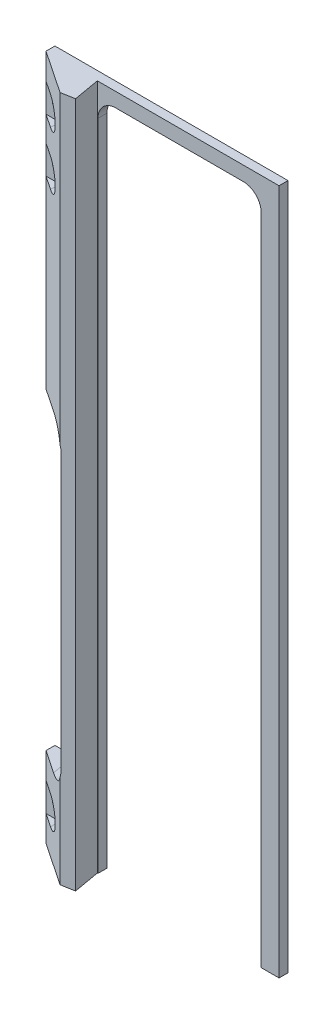
ISO-10303-21;
HEADER;
FILE_DESCRIPTION(('STEP AP214'),'2;1');
FILE_NAME('part.step','',(''),(''),'','','');
FILE_SCHEMA(('AUTOMOTIVE_DESIGN { 1 0 10303 214 1 1 1 1 }'));
ENDSEC;
DATA;
#1=APPLICATION_CONTEXT('core data for automotive mechanical design processes');
#2=APPLICATION_PROTOCOL_DEFINITION('international standard','automotive_design',2000,#1);
#3=PRODUCT_CONTEXT('',#1,'mechanical');
#4=PRODUCT('Part','Part','',(#3));
#5=PRODUCT_RELATED_PRODUCT_CATEGORY('part','',(#4));
#6=PRODUCT_DEFINITION_FORMATION('','',#4);
#7=PRODUCT_DEFINITION_CONTEXT('part definition',#1,'design');
#8=PRODUCT_DEFINITION('design','',#6,#7);
#9=PRODUCT_DEFINITION_SHAPE('','',#8);
#10=(LENGTH_UNIT() NAMED_UNIT(*) SI_UNIT(.MILLI.,.METRE.));
#11=(NAMED_UNIT(*) PLANE_ANGLE_UNIT() SI_UNIT($,.RADIAN.));
#12=(NAMED_UNIT(*) SI_UNIT($,.STERADIAN.) SOLID_ANGLE_UNIT());
#13=UNCERTAINTY_MEASURE_WITH_UNIT(LENGTH_MEASURE(1.E-05),#10,'distance_accuracy_value','');
#14=(GEOMETRIC_REPRESENTATION_CONTEXT(3) GLOBAL_UNCERTAINTY_ASSIGNED_CONTEXT((#13)) GLOBAL_UNIT_ASSIGNED_CONTEXT((#10,
#11,#12)) REPRESENTATION_CONTEXT('',''));
#15=CARTESIAN_POINT('',(0.,0.,0.));
#16=DIRECTION('',(0.,0.,1.));
#17=DIRECTION('',(1.,0.,0.));
#18=AXIS2_PLACEMENT_3D('',#15,#16,#17);
#19=CARTESIAN_POINT('',(828.768626089642,5932.05250361917,3.175));
#20=DIRECTION('',(-0.557788188531674,0.,0.829983335214963));
#21=DIRECTION('',(0.829983335214963,0.,0.557788188531674));
#22=AXIS2_PLACEMENT_3D('',#19,#20,#21);
#23=PLANE('',#22);
#24=DIRECTION('',(0.,-1.,0.));
#25=VECTOR('',#24,1.);
#26=CARTESIAN_POINT('',(828.768626089642,5932.05250361917,3.175));
#27=LINE('',#26,#25);
#28=CARTESIAN_POINT('',(828.768626089642,5960.62750361917,3.17499999999996));
#29=VERTEX_POINT('',#28);
#30=CARTESIAN_POINT('',(828.768626089642,5951.42000361917,3.175));
#31=VERTEX_POINT('',#30);
#32=EDGE_CURVE('E403',#29,#31,#27,.T.);
#33=ORIENTED_EDGE('',*,*,#32,.T.);
#34=DIRECTION('',(0.829983335214963,0.,0.557788188531674));
#35=VECTOR('',#34,1.);
#36=CARTESIAN_POINT('',(828.768626089642,5951.42000361917,3.175));
#37=LINE('',#36,#35);
#38=CARTESIAN_POINT('',(833.658126089642,5951.42000361917,6.46097603362633));
#39=VERTEX_POINT('',#38);
#40=EDGE_CURVE('E12',#31,#39,#37,.T.);
#41=ORIENTED_EDGE('',*,*,#40,.T.);
#42=CARTESIAN_POINT('',(833.658126089642,5946.34000361917,6.46097603362633));
#43=DIRECTION('',(-0.557788188531674,0.,0.829983335214963));
#44=DIRECTION('',(-0.829983335214963,0.,-0.557788188531674));
#45=AXIS2_PLACEMENT_3D('',#42,#43,#44);
#46=ELLIPSE('',#45,6.12060481754699,5.08000000000042);
#47=CARTESIAN_POINT('',(833.658126089642,5941.26000361917,6.46097603362633));
#48=VERTEX_POINT('',#47);
#49=EDGE_CURVE('E50',#39,#48,#46,.F.);
#50=ORIENTED_EDGE('',*,*,#49,.T.);
#51=DIRECTION('',(-0.829983335214963,0.,-0.557788188531674));
#52=VECTOR('',#51,1.);
#53=CARTESIAN_POINT('',(828.768626089642,5941.26000361917,3.175));
#54=LINE('',#53,#52);
#55=CARTESIAN_POINT('',(828.768626089642,5941.26000361917,3.175));
#56=VERTEX_POINT('',#55);
#57=EDGE_CURVE('E520',#48,#56,#54,.T.);
#58=ORIENTED_EDGE('',*,*,#57,.T.);
#59=CARTESIAN_POINT('',(828.768626089642,5932.05250361917,3.175));
#60=VERTEX_POINT('',#59);
#61=EDGE_CURVE('E402',#56,#60,#27,.T.);
#62=ORIENTED_EDGE('',*,*,#61,.T.);
#63=DIRECTION('',(0.829983335214963,0.,0.557788188531674));
#64=VECTOR('',#63,1.);
#65=CARTESIAN_POINT('',(828.768626089642,5932.05250361917,3.175));
#66=LINE('',#65,#64);
#67=CARTESIAN_POINT('',(843.956978058199,5932.05250361917,13.38229329358));
#68=VERTEX_POINT('',#67);
#69=EDGE_CURVE('E366',#60,#68,#66,.T.);
#70=ORIENTED_EDGE('',*,*,#69,.T.);
#71=DIRECTION('',(0.,1.,0.));
#72=VECTOR('',#71,1.);
#73=CARTESIAN_POINT('',(843.956978058199,5932.05250361917,13.38229329358));
#74=LINE('',#73,#72);
#75=CARTESIAN_POINT('',(843.956978058199,5965.12288629274,13.38229329358));
#76=VERTEX_POINT('',#75);
#77=EDGE_CURVE('E395',#68,#76,#74,.T.);
#78=ORIENTED_EDGE('',*,*,#77,.T.);
#79=CARTESIAN_POINT('',(836.961155723783,5966.97750361917,8.68076869466398));
#80=DIRECTION('',(-0.557788188531674,0.,0.829983335214963));
#81=DIRECTION('',(0.829983335214963,0.,0.557788188531674));
#82=AXIS2_PLACEMENT_3D('',#79,#80,#81);
#83=ELLIPSE('',#82,8.81313912166303,6.35);
#84=CARTESIAN_POINT('',(836.961155723783,5960.62750361917,8.68076869466399));
#85=VERTEX_POINT('',#84);
#86=EDGE_CURVE('E470',#76,#85,#83,.F.);
#87=ORIENTED_EDGE('',*,*,#86,.T.);
#88=DIRECTION('',(0.829983335214963,0.,0.557788188531674));
#89=VECTOR('',#88,1.);
#90=CARTESIAN_POINT('',(828.768626089642,5960.62750361917,3.175));
#91=LINE('',#90,#89);
#92=EDGE_CURVE('E442',#29,#85,#91,.T.);
#93=ORIENTED_EDGE('',*,*,#92,.F.);
#94=EDGE_LOOP('',(#33,#41,#50,#58,#62,#70,#78,#87,#93));
#95=FACE_BOUND('',#94,.T.);
#96=ADVANCED_FACE('F42',(#95),#23,.T.);
#97=CARTESIAN_POINT('',(828.768626089642,6175.65091551716,3.175));
#98=VERTEX_POINT('',#97);
#99=CARTESIAN_POINT('',(828.768626089642,6166.44341551716,3.175));
#100=VERTEX_POINT('',#99);
#101=EDGE_CURVE('E397',#98,#100,#27,.T.);
#102=ORIENTED_EDGE('',*,*,#101,.T.);
#103=DIRECTION('',(0.829983335214963,0.,0.557788188531674));
#104=VECTOR('',#103,1.);
#105=CARTESIAN_POINT('',(828.768626089642,6166.44341551716,3.175));
#106=LINE('',#105,#104);
#107=CARTESIAN_POINT('',(833.658126089642,6166.44341551716,6.46097603362633));
#108=VERTEX_POINT('',#107);
#109=EDGE_CURVE('E266',#100,#108,#106,.T.);
#110=ORIENTED_EDGE('',*,*,#109,.T.);
#111=CARTESIAN_POINT('',(833.658126089642,6161.36341551716,6.46097603362633));
#112=DIRECTION('',(-0.557788188531674,0.,0.829983335214963));
#113=DIRECTION('',(-0.829983335214963,0.,-0.557788188531674));
#114=AXIS2_PLACEMENT_3D('',#111,#112,#113);
#115=ELLIPSE('',#114,6.12060481754699,5.08000000000042);
#116=CARTESIAN_POINT('',(833.658126089642,6156.28341551716,6.46097603362633));
#117=VERTEX_POINT('',#116);
#118=EDGE_CURVE('E256',#108,#117,#115,.F.);
#119=ORIENTED_EDGE('',*,*,#118,.T.);
#120=DIRECTION('',(-0.829983335214963,0.,-0.557788188531674));
#121=VECTOR('',#120,1.);
#122=CARTESIAN_POINT('',(828.768626089642,6156.28341551716,3.175));
#123=LINE('',#122,#121);
#124=CARTESIAN_POINT('',(828.768626089642,6156.28341551716,3.175));
#125=VERTEX_POINT('',#124);
#126=EDGE_CURVE('E512',#117,#125,#123,.T.);
#127=ORIENTED_EDGE('',*,*,#126,.T.);
#128=CARTESIAN_POINT('',(828.768626089642,6147.39341551716,3.175));
#129=VERTEX_POINT('',#128);
#130=EDGE_CURVE('E401',#125,#129,#27,.T.);
#131=ORIENTED_EDGE('',*,*,#130,.T.);
#132=DIRECTION('',(0.829983335214963,0.,0.557788188531674));
#133=VECTOR('',#132,1.);
#134=CARTESIAN_POINT('',(828.768626089642,6147.39341551716,3.175));
#135=LINE('',#134,#133);
#136=CARTESIAN_POINT('',(833.658126089642,6147.39341551716,6.46097603362633));
#137=VERTEX_POINT('',#136);
#138=EDGE_CURVE('E509',#129,#137,#135,.T.);
#139=ORIENTED_EDGE('',*,*,#138,.T.);
#140=CARTESIAN_POINT('',(833.658126089642,6142.31341551716,6.46097603362633));
#141=DIRECTION('',(-0.557788188531674,0.,0.829983335214963));
#142=DIRECTION('',(-0.829983335214963,0.,-0.557788188531674));
#143=AXIS2_PLACEMENT_3D('',#140,#141,#142);
#144=ELLIPSE('',#143,6.12060481754699,5.08000000000042);
#145=CARTESIAN_POINT('',(833.658126089642,6137.23341551716,6.46097603362633));
#146=VERTEX_POINT('',#145);
#147=EDGE_CURVE('E505',#137,#146,#144,.F.);
#148=ORIENTED_EDGE('',*,*,#147,.T.);
#149=DIRECTION('',(-0.829983335214963,0.,-0.557788188531674));
#150=VECTOR('',#149,1.);
#151=CARTESIAN_POINT('',(828.768626089642,6137.23341551716,3.175));
#152=LINE('',#151,#150);
#153=CARTESIAN_POINT('',(828.768626089642,6137.23341551716,3.175));
#154=VERTEX_POINT('',#153);
#155=EDGE_CURVE('E494',#146,#154,#152,.T.);
#156=ORIENTED_EDGE('',*,*,#155,.T.);
#157=CARTESIAN_POINT('',(828.768626089642,6071.75250361917,3.17499999999996));
#158=VERTEX_POINT('',#157);
#159=EDGE_CURVE('E642',#154,#158,#27,.T.);
#160=ORIENTED_EDGE('',*,*,#159,.T.);
#161=DIRECTION('',(-0.829983335214963,0.,-0.557788188531674));
#162=VECTOR('',#161,1.);
#163=CARTESIAN_POINT('',(828.768626089642,6071.75250361917,3.175));
#164=LINE('',#163,#162);
#165=CARTESIAN_POINT('',(836.961155723783,6071.75250361917,8.68076869466401));
#166=VERTEX_POINT('',#165);
#167=EDGE_CURVE('E439',#166,#158,#164,.T.);
#168=ORIENTED_EDGE('',*,*,#167,.F.);
#169=CARTESIAN_POINT('',(836.961155723783,6065.40250361917,8.68076869466398));
#170=DIRECTION('',(-0.557788188531674,0.,0.829983335214963));
#171=DIRECTION('',(0.829983335214963,0.,0.557788188531674));
#172=AXIS2_PLACEMENT_3D('',#169,#170,#171);
#173=ELLIPSE('',#172,8.81313912166303,6.35);
#174=CARTESIAN_POINT('',(843.956978058199,6067.2571209456,13.38229329358));
#175=VERTEX_POINT('',#174);
#176=EDGE_CURVE('E460',#166,#175,#173,.F.);
#177=ORIENTED_EDGE('',*,*,#176,.T.);
#178=CARTESIAN_POINT('',(843.956978058199,6175.65091551716,13.38229329358));
#179=VERTEX_POINT('',#178);
#180=EDGE_CURVE('E376',#175,#179,#74,.T.);
#181=ORIENTED_EDGE('',*,*,#180,.T.);
#182=DIRECTION('',(0.829983335214963,0.,0.557788188531674));
#183=VECTOR('',#182,1.);
#184=CARTESIAN_POINT('',(828.768626089642,6175.65091551716,3.175));
#185=LINE('',#184,#183);
#186=EDGE_CURVE('E365',#98,#179,#185,.T.);
#187=ORIENTED_EDGE('',*,*,#186,.F.);
#188=EDGE_LOOP('',(#102,#110,#119,#127,#131,#139,#148,#156,#160,#168,#177,#181,#187));
#189=FACE_BOUND('',#188,.T.);
#190=ADVANCED_FACE('F546',(#189),#23,.T.);
#191=CARTESIAN_POINT('',(833.658126089642,5946.34000361917,0.));
#192=DIRECTION('',(0.,0.,-1.));
#193=DIRECTION('',(-1.,0.,0.));
#194=AXIS2_PLACEMENT_3D('',#191,#192,#193);
#195=CYLINDRICAL_SURFACE('',#194,2.5908);
#196=CARTESIAN_POINT('',(833.658126089642,5946.34000361917,0.));
#197=DIRECTION('',(0.,0.,-1.));
#198=DIRECTION('',(-1.,0.,0.));
#199=AXIS2_PLACEMENT_3D('',#196,#197,#198);
#200=CIRCLE('',#199,2.5908);
#201=CARTESIAN_POINT('',(831.067326089642,5946.34000361917,0.));
#202=VERTEX_POINT('',#201);
#203=EDGE_CURVE('E321',#202,#202,#200,.T.);
#204=ORIENTED_EDGE('',*,*,#203,.T.);
#205=EDGE_LOOP('',(#204));
#206=FACE_BOUND('',#205,.T.);
#207=CARTESIAN_POINT('',(833.658126089642,5946.34000361917,3.175));
#208=DIRECTION('',(0.,0.,1.));
#209=DIRECTION('',(1.,0.,0.));
#210=AXIS2_PLACEMENT_3D('',#207,#208,#209);
#211=CIRCLE('',#210,2.5908);
#212=CARTESIAN_POINT('',(836.248926089642,5946.34000361917,3.175));
#213=VERTEX_POINT('',#212);
#214=EDGE_CURVE('E310',#213,#213,#211,.F.);
#215=ORIENTED_EDGE('',*,*,#214,.F.);
#216=EDGE_LOOP('',(#215));
#217=FACE_BOUND('',#216,.T.);
#218=ADVANCED_FACE('F551',(#206,#217),#195,.F.);
#219=CARTESIAN_POINT('',(833.658126089642,6142.31341551716,0.));
#220=DIRECTION('',(0.,0.,-1.));
#221=DIRECTION('',(-1.,0.,0.));
#222=AXIS2_PLACEMENT_3D('',#219,#220,#221);
#223=CYLINDRICAL_SURFACE('',#222,2.5908);
#224=CARTESIAN_POINT('',(833.658126089642,6142.31341551716,0.));
#225=DIRECTION('',(0.,0.,-1.));
#226=DIRECTION('',(-1.,0.,0.));
#227=AXIS2_PLACEMENT_3D('',#224,#225,#226);
#228=CIRCLE('',#227,2.5908);
#229=CARTESIAN_POINT('',(831.067326089642,6142.31341551716,0.));
#230=VERTEX_POINT('',#229);
#231=EDGE_CURVE('E318',#230,#230,#228,.T.);
#232=ORIENTED_EDGE('',*,*,#231,.T.);
#233=EDGE_LOOP('',(#232));
#234=FACE_BOUND('',#233,.T.);
#235=CARTESIAN_POINT('',(833.658126089642,6142.31341551716,3.175));
#236=DIRECTION('',(0.,0.,1.));
#237=DIRECTION('',(1.,0.,0.));
#238=AXIS2_PLACEMENT_3D('',#235,#236,#237);
#239=CIRCLE('',#238,2.5908);
#240=CARTESIAN_POINT('',(836.248926089642,6142.31341551716,3.175));
#241=VERTEX_POINT('',#240);
#242=EDGE_CURVE('E306',#241,#241,#239,.F.);
#243=ORIENTED_EDGE('',*,*,#242,.F.);
#244=EDGE_LOOP('',(#243));
#245=FACE_BOUND('',#244,.T.);
#246=ADVANCED_FACE('F702',(#234,#245),#223,.F.);
#247=CARTESIAN_POINT('',(833.658126089642,6161.36341551716,0.));
#248=DIRECTION('',(0.,0.,-1.));
#249=DIRECTION('',(-1.,0.,0.));
#250=AXIS2_PLACEMENT_3D('',#247,#248,#249);
#251=CYLINDRICAL_SURFACE('',#250,2.5908);
#252=CARTESIAN_POINT('',(833.658126089642,6161.36341551716,0.));
#253=DIRECTION('',(0.,0.,-1.));
#254=DIRECTION('',(-1.,0.,0.));
#255=AXIS2_PLACEMENT_3D('',#252,#253,#254);
#256=CIRCLE('',#255,2.5908);
#257=CARTESIAN_POINT('',(831.067326089642,6161.36341551716,0.));
#258=VERTEX_POINT('',#257);
#259=EDGE_CURVE('E314',#258,#258,#256,.T.);
#260=ORIENTED_EDGE('',*,*,#259,.T.);
#261=EDGE_LOOP('',(#260));
#262=FACE_BOUND('',#261,.T.);
#263=CARTESIAN_POINT('',(833.658126089642,6161.36341551716,3.175));
#264=DIRECTION('',(0.,0.,1.));
#265=DIRECTION('',(1.,0.,0.));
#266=AXIS2_PLACEMENT_3D('',#263,#264,#265);
#267=CIRCLE('',#266,2.5908);
#268=CARTESIAN_POINT('',(836.248926089642,6161.36341551716,3.175));
#269=VERTEX_POINT('',#268);
#270=EDGE_CURVE('E261',#269,#269,#267,.F.);
#271=ORIENTED_EDGE('',*,*,#270,.F.);
#272=EDGE_LOOP('',(#271));
#273=FACE_BOUND('',#272,.T.);
#274=ADVANCED_FACE('F699',(#262,#273),#251,.F.);
#275=CARTESIAN_POINT('',(828.768626089642,5932.05250361917,3.175));
#276=DIRECTION('',(0.,1.,0.));
#277=DIRECTION('',(0.,0.,1.));
#278=AXIS2_PLACEMENT_3D('',#275,#276,#277);
#279=PLANE('',#278);
#280=DIRECTION('',(1.,0.,0.));
#281=VECTOR('',#280,1.);
#282=CARTESIAN_POINT('',(828.768626089642,5932.05250361917,3.175));
#283=LINE('',#282,#281);
#284=CARTESIAN_POINT('',(905.156670117878,5932.05250361917,3.175));
#285=VERTEX_POINT('',#284);
#286=CARTESIAN_POINT('',(911.506670117877,5932.05250361917,3.175));
#287=VERTEX_POINT('',#286);
#288=EDGE_CURVE('E400',#285,#287,#283,.T.);
#289=ORIENTED_EDGE('',*,*,#288,.F.);
#290=DIRECTION('',(0.,0.,1.));
#291=VECTOR('',#290,1.);
#292=CARTESIAN_POINT('',(905.156670117878,5932.05250361917,0.));
#293=LINE('',#292,#291);
#294=CARTESIAN_POINT('',(905.156670117878,5932.05250361917,0.));
#295=VERTEX_POINT('',#294);
#296=EDGE_CURVE('E346',#295,#285,#293,.T.);
#297=ORIENTED_EDGE('',*,*,#296,.F.);
#298=DIRECTION('',(1.,0.,0.));
#299=VECTOR('',#298,1.);
#300=CARTESIAN_POINT('',(828.768626089642,5932.05250361917,0.));
#301=LINE('',#300,#299);
#302=CARTESIAN_POINT('',(911.506670117877,5932.05250361917,0.));
#303=VERTEX_POINT('',#302);
#304=EDGE_CURVE('E417',#295,#303,#301,.T.);
#305=ORIENTED_EDGE('',*,*,#304,.T.);
#306=DIRECTION('',(0.,0.,-1.));
#307=VECTOR('',#306,1.);
#308=CARTESIAN_POINT('',(911.506670117877,5932.05250361917,3.175));
#309=LINE('',#308,#307);
#310=EDGE_CURVE('E432',#287,#303,#309,.T.);
#311=ORIENTED_EDGE('',*,*,#310,.F.);
#312=EDGE_LOOP('',(#289,#297,#305,#311));
#313=FACE_BOUND('',#312,.T.);
#314=ADVANCED_FACE('F580',(#313),#279,.F.);
#315=CARTESIAN_POINT('',(828.768626089642,5932.05250361917,3.175));
#316=DIRECTION('',(1.,0.,0.));
#317=DIRECTION('',(0.,0.,-1.));
#318=AXIS2_PLACEMENT_3D('',#315,#316,#317);
#319=PLANE('',#318);
#320=ORIENTED_EDGE('',*,*,#32,.F.);
#321=DIRECTION('',(0.,0.,-1.));
#322=VECTOR('',#321,1.);
#323=CARTESIAN_POINT('',(828.768626089642,5960.62750361917,3.175));
#324=LINE('',#323,#322);
#325=CARTESIAN_POINT('',(828.768626089642,5960.62750361917,0.));
#326=VERTEX_POINT('',#325);
#327=EDGE_CURVE('E357',#29,#326,#324,.T.);
#328=ORIENTED_EDGE('',*,*,#327,.T.);
#329=DIRECTION('',(0.,-1.,0.));
#330=VECTOR('',#329,1.);
#331=CARTESIAN_POINT('',(828.768626089642,5932.05250361917,0.));
#332=LINE('',#331,#330);
#333=CARTESIAN_POINT('',(828.768626089642,5932.05250361917,0.));
#334=VERTEX_POINT('',#333);
#335=EDGE_CURVE('E391',#326,#334,#332,.T.);
#336=ORIENTED_EDGE('',*,*,#335,.T.);
#337=DIRECTION('',(0.,0.,-1.));
#338=VECTOR('',#337,1.);
#339=CARTESIAN_POINT('',(828.768626089642,5932.05250361917,3.175));
#340=LINE('',#339,#338);
#341=EDGE_CURVE('E436',#60,#334,#340,.T.);
#342=ORIENTED_EDGE('',*,*,#341,.F.);
#343=ORIENTED_EDGE('',*,*,#61,.F.);
#344=DIRECTION('',(0.,1.,0.));
#345=VECTOR('',#344,1.);
#346=CARTESIAN_POINT('',(828.768626089642,5932.05250361917,3.175));
#347=LINE('',#346,#345);
#348=EDGE_CURVE('E311',#56,#31,#347,.T.);
#349=ORIENTED_EDGE('',*,*,#348,.T.);
#350=EDGE_LOOP('',(#320,#328,#336,#342,#343,#349));
#351=FACE_BOUND('',#350,.T.);
#352=ADVANCED_FACE('F561',(#351),#319,.F.);
#353=CARTESIAN_POINT('',(0.,0.,3.175));
#354=DIRECTION('',(0.,0.,-1.));
#355=DIRECTION('',(-1.,0.,0.));
#356=AXIS2_PLACEMENT_3D('',#353,#354,#355);
#357=PLANE('',#356);
#358=DIRECTION('',(-1.,0.,0.));
#359=VECTOR('',#358,1.);
#360=CARTESIAN_POINT('',(905.156670117878,6170.57091551716,3.175));
#361=LINE('',#360,#359);
#362=CARTESIAN_POINT('',(898.806670117878,6170.57091551716,3.175));
#363=VERTEX_POINT('',#362);
#364=CARTESIAN_POINT('',(853.550799138848,6170.57091551716,3.175));
#365=VERTEX_POINT('',#364);
#366=EDGE_CURVE('E340',#363,#365,#361,.T.);
#367=ORIENTED_EDGE('',*,*,#366,.F.);
#368=CARTESIAN_POINT('',(898.806670117878,6164.22091551716,3.175));
#369=DIRECTION('',(0.,0.,-1.));
#370=DIRECTION('',(-1.,0.,0.));
#371=AXIS2_PLACEMENT_3D('',#368,#369,#370);
#372=CIRCLE('',#371,6.35);
#373=CARTESIAN_POINT('',(905.156670117878,6164.22091551716,3.175));
#374=VERTEX_POINT('',#373);
#375=EDGE_CURVE('E490',#363,#374,#372,.T.);
#376=ORIENTED_EDGE('',*,*,#375,.T.);
#377=DIRECTION('',(0.,1.,0.));
#378=VECTOR('',#377,1.);
#379=CARTESIAN_POINT('',(905.156670117878,5932.05250361917,3.175));
#380=LINE('',#379,#378);
#381=EDGE_CURVE('E324',#285,#374,#380,.T.);
#382=ORIENTED_EDGE('',*,*,#381,.F.);
#383=ORIENTED_EDGE('',*,*,#288,.T.);
#384=DIRECTION('',(0.,1.,0.));
#385=VECTOR('',#384,1.);
#386=CARTESIAN_POINT('',(911.506670117877,5932.05250361917,3.175));
#387=LINE('',#386,#385);
#388=CARTESIAN_POINT('',(911.506670117877,6175.65091551716,3.175));
#389=VERTEX_POINT('',#388);
#390=EDGE_CURVE('E407',#287,#389,#387,.T.);
#391=ORIENTED_EDGE('',*,*,#390,.T.);
#392=DIRECTION('',(-1.,0.,0.));
#393=VECTOR('',#392,1.);
#394=CARTESIAN_POINT('',(828.768626089642,6175.65091551716,3.175));
#395=LINE('',#394,#393);
#396=CARTESIAN_POINT('',(846.993126089642,6175.65091551716,3.175));
#397=VERTEX_POINT('',#396);
#398=EDGE_CURVE('E410',#389,#397,#395,.T.);
#399=ORIENTED_EDGE('',*,*,#398,.T.);
#400=DIRECTION('',(0.,1.,0.));
#401=VECTOR('',#400,1.);
#402=CARTESIAN_POINT('',(846.993126089642,5932.05250361917,3.175));
#403=LINE('',#402,#401);
#404=CARTESIAN_POINT('',(846.993126089642,5932.05250361917,3.175));
#405=VERTEX_POINT('',#404);
#406=EDGE_CURVE('E387',#405,#397,#403,.T.);
#407=ORIENTED_EDGE('',*,*,#406,.F.);
#408=CARTESIAN_POINT('',(847.200799138848,5932.05250361917,3.175));
#409=VERTEX_POINT('',#408);
#410=EDGE_CURVE('E404',#405,#409,#283,.T.);
#411=ORIENTED_EDGE('',*,*,#410,.T.);
#412=DIRECTION('',(0.,-1.,0.));
#413=VECTOR('',#412,1.);
#414=CARTESIAN_POINT('',(847.200799138848,6170.57091551716,3.175));
#415=LINE('',#414,#413);
#416=CARTESIAN_POINT('',(847.200799138848,6164.22091551716,3.175));
#417=VERTEX_POINT('',#416);
#418=EDGE_CURVE('E330',#417,#409,#415,.T.);
#419=ORIENTED_EDGE('',*,*,#418,.F.);
#420=CARTESIAN_POINT('',(853.550799138848,6164.22091551716,3.175));
#421=DIRECTION('',(0.,0.,-1.));
#422=DIRECTION('',(-1.,0.,0.));
#423=AXIS2_PLACEMENT_3D('',#420,#421,#422);
#424=CIRCLE('',#423,6.35);
#425=EDGE_CURVE('E484',#417,#365,#424,.T.);
#426=ORIENTED_EDGE('',*,*,#425,.T.);
#427=EDGE_LOOP('',(#367,#376,#382,#383,#391,#399,#407,#411,#419,#426));
#428=FACE_BOUND('',#427,.T.);
#429=ADVANCED_FACE('F557',(#428),#357,.F.);
#430=CARTESIAN_POINT('',(828.768626089642,6175.65091551716,0.));
#431=VERTEX_POINT('',#430);
#432=CARTESIAN_POINT('',(828.768626089642,6071.75250361917,0.));
#433=VERTEX_POINT('',#432);
#434=EDGE_CURVE('E414',#431,#433,#332,.T.);
#435=ORIENTED_EDGE('',*,*,#434,.T.);
#436=DIRECTION('',(0.,0.,1.));
#437=VECTOR('',#436,1.);
#438=CARTESIAN_POINT('',(828.768626089642,6071.75250361917,3.175));
#439=LINE('',#438,#437);
#440=EDGE_CURVE('E349',#433,#158,#439,.T.);
#441=ORIENTED_EDGE('',*,*,#440,.T.);
#442=ORIENTED_EDGE('',*,*,#159,.F.);
#443=DIRECTION('',(0.,1.,0.));
#444=VECTOR('',#443,1.);
#445=CARTESIAN_POINT('',(828.768626089642,5932.05250361917,3.175));
#446=LINE('',#445,#444);
#447=EDGE_CURVE('E307',#154,#129,#446,.T.);
#448=ORIENTED_EDGE('',*,*,#447,.T.);
#449=ORIENTED_EDGE('',*,*,#130,.F.);
#450=DIRECTION('',(0.,1.,0.));
#451=VECTOR('',#450,1.);
#452=CARTESIAN_POINT('',(828.768626089642,5932.05250361917,3.175));
#453=LINE('',#452,#451);
#454=EDGE_CURVE('E304',#125,#100,#453,.T.);
#455=ORIENTED_EDGE('',*,*,#454,.T.);
#456=ORIENTED_EDGE('',*,*,#101,.F.);
#457=DIRECTION('',(0.,0.,-1.));
#458=VECTOR('',#457,1.);
#459=CARTESIAN_POINT('',(828.768626089642,6175.65091551716,3.175));
#460=LINE('',#459,#458);
#461=EDGE_CURVE('E413',#98,#431,#460,.T.);
#462=ORIENTED_EDGE('',*,*,#461,.T.);
#463=EDGE_LOOP('',(#435,#441,#442,#448,#449,#455,#456,#462));
#464=FACE_BOUND('',#463,.T.);
#465=ADVANCED_FACE('F560',(#464),#319,.F.);
#466=CARTESIAN_POINT('',(847.200799138848,5932.05250361917,0.));
#467=VERTEX_POINT('',#466);
#468=EDGE_CURVE('E418',#334,#467,#301,.T.);
#469=ORIENTED_EDGE('',*,*,#468,.T.);
#470=DIRECTION('',(0.,0.,1.));
#471=VECTOR('',#470,1.);
#472=CARTESIAN_POINT('',(847.200799138848,5932.05250361917,0.));
#473=LINE('',#472,#471);
#474=EDGE_CURVE('E336',#467,#409,#473,.T.);
#475=ORIENTED_EDGE('',*,*,#474,.T.);
#476=ORIENTED_EDGE('',*,*,#410,.F.);
#477=DIRECTION('',(-0.173648177666937,0.,-0.984807753012207));
#478=VECTOR('',#477,1.);
#479=CARTESIAN_POINT('',(848.64712498192,5932.05250361917,12.5552938474413));
#480=LINE('',#479,#478);
#481=CARTESIAN_POINT('',(848.64712498192,5932.05250361917,12.5552938474413));
#482=VERTEX_POINT('',#481);
#483=EDGE_CURVE('E373',#482,#405,#480,.T.);
#484=ORIENTED_EDGE('',*,*,#483,.F.);
#485=DIRECTION('',(0.984807753012208,0.,-0.17364817766693));
#486=VECTOR('',#485,1.);
#487=CARTESIAN_POINT('',(843.956978058199,5932.05250361917,13.38229329358));
#488=LINE('',#487,#486);
#489=EDGE_CURVE('E369',#68,#482,#488,.T.);
#490=ORIENTED_EDGE('',*,*,#489,.F.);
#491=ORIENTED_EDGE('',*,*,#69,.F.);
#492=ORIENTED_EDGE('',*,*,#341,.T.);
#493=EDGE_LOOP('',(#469,#475,#476,#484,#490,#491,#492));
#494=FACE_BOUND('',#493,.T.);
#495=ADVANCED_FACE('F575',(#494),#279,.F.);
#496=CARTESIAN_POINT('',(911.506670117877,5932.05250361917,3.175));
#497=DIRECTION('',(-1.,0.,0.));
#498=DIRECTION('',(0.,0.,1.));
#499=AXIS2_PLACEMENT_3D('',#496,#497,#498);
#500=PLANE('',#499);
#501=DIRECTION('',(0.,1.,0.));
#502=VECTOR('',#501,1.);
#503=CARTESIAN_POINT('',(911.506670117877,5932.05250361917,0.));
#504=LINE('',#503,#502);
#505=CARTESIAN_POINT('',(911.506670117877,6175.65091551716,0.));
#506=VERTEX_POINT('',#505);
#507=EDGE_CURVE('E421',#303,#506,#504,.T.);
#508=ORIENTED_EDGE('',*,*,#507,.T.);
#509=DIRECTION('',(0.,0.,-1.));
#510=VECTOR('',#509,1.);
#511=CARTESIAN_POINT('',(911.506670117877,6175.65091551716,3.175));
#512=LINE('',#511,#510);
#513=EDGE_CURVE('E429',#389,#506,#512,.T.);
#514=ORIENTED_EDGE('',*,*,#513,.F.);
#515=ORIENTED_EDGE('',*,*,#390,.F.);
#516=ORIENTED_EDGE('',*,*,#310,.T.);
#517=EDGE_LOOP('',(#508,#514,#515,#516));
#518=FACE_BOUND('',#517,.T.);
#519=ADVANCED_FACE('F571',(#518),#500,.F.);
#520=CARTESIAN_POINT('',(828.768626089642,6175.65091551716,3.175));
#521=DIRECTION('',(0.,-1.,0.));
#522=DIRECTION('',(0.,0.,-1.));
#523=AXIS2_PLACEMENT_3D('',#520,#521,#522);
#524=PLANE('',#523);
#525=DIRECTION('',(-1.,0.,0.));
#526=VECTOR('',#525,1.);
#527=CARTESIAN_POINT('',(828.768626089642,6175.65091551716,0.));
#528=LINE('',#527,#526);
#529=EDGE_CURVE('E424',#506,#431,#528,.T.);
#530=ORIENTED_EDGE('',*,*,#529,.T.);
#531=ORIENTED_EDGE('',*,*,#461,.F.);
#532=ORIENTED_EDGE('',*,*,#186,.T.);
#533=DIRECTION('',(0.984807753012208,0.,-0.17364817766693));
#534=VECTOR('',#533,1.);
#535=CARTESIAN_POINT('',(843.956978058199,6175.65091551716,13.38229329358));
#536=LINE('',#535,#534);
#537=CARTESIAN_POINT('',(848.64712498192,6175.65091551716,12.5552938474413));
#538=VERTEX_POINT('',#537);
#539=EDGE_CURVE('E380',#179,#538,#536,.T.);
#540=ORIENTED_EDGE('',*,*,#539,.T.);
#541=DIRECTION('',(-0.173648177666937,0.,-0.984807753012207));
#542=VECTOR('',#541,1.);
#543=CARTESIAN_POINT('',(848.64712498192,6175.65091551716,12.5552938474413));
#544=LINE('',#543,#542);
#545=EDGE_CURVE('E370',#538,#397,#544,.T.);
#546=ORIENTED_EDGE('',*,*,#545,.T.);
#547=ORIENTED_EDGE('',*,*,#398,.F.);
#548=ORIENTED_EDGE('',*,*,#513,.T.);
#549=EDGE_LOOP('',(#530,#531,#532,#540,#546,#547,#548));
#550=FACE_BOUND('',#549,.T.);
#551=ADVANCED_FACE('F567',(#550),#524,.F.);
#552=CARTESIAN_POINT('',(0.,0.,0.));
#553=DIRECTION('',(0.,0.,-1.));
#554=DIRECTION('',(-1.,0.,0.));
#555=AXIS2_PLACEMENT_3D('',#552,#553,#554);
#556=PLANE('',#555);
#557=ORIENTED_EDGE('',*,*,#259,.F.);
#558=EDGE_LOOP('',(#557));
#559=FACE_BOUND('',#558,.T.);
#560=ORIENTED_EDGE('',*,*,#231,.F.);
#561=EDGE_LOOP('',(#560));
#562=FACE_BOUND('',#561,.T.);
#563=ORIENTED_EDGE('',*,*,#203,.F.);
#564=EDGE_LOOP('',(#563));
#565=FACE_BOUND('',#564,.T.);
#566=DIRECTION('',(0.,1.,0.));
#567=VECTOR('',#566,1.);
#568=CARTESIAN_POINT('',(905.156670117878,5932.05250361917,0.));
#569=LINE('',#568,#567);
#570=CARTESIAN_POINT('',(905.156670117878,6164.22091551716,0.));
#571=VERTEX_POINT('',#570);
#572=EDGE_CURVE('E325',#295,#571,#569,.T.);
#573=ORIENTED_EDGE('',*,*,#572,.T.);
#574=CARTESIAN_POINT('',(898.806670117878,6164.22091551716,0.));
#575=DIRECTION('',(0.,0.,-1.));
#576=DIRECTION('',(-1.,0.,0.));
#577=AXIS2_PLACEMENT_3D('',#574,#575,#576);
#578=CIRCLE('',#577,6.35);
#579=CARTESIAN_POINT('',(898.806670117878,6170.57091551716,0.));
#580=VERTEX_POINT('',#579);
#581=EDGE_CURVE('E492',#571,#580,#578,.F.);
#582=ORIENTED_EDGE('',*,*,#581,.T.);
#583=DIRECTION('',(-1.,0.,0.));
#584=VECTOR('',#583,1.);
#585=CARTESIAN_POINT('',(905.156670117878,6170.57091551716,0.));
#586=LINE('',#585,#584);
#587=CARTESIAN_POINT('',(853.550799138848,6170.57091551716,0.));
#588=VERTEX_POINT('',#587);
#589=EDGE_CURVE('E329',#580,#588,#586,.T.);
#590=ORIENTED_EDGE('',*,*,#589,.T.);
#591=CARTESIAN_POINT('',(853.550799138848,6164.22091551716,0.));
#592=DIRECTION('',(0.,0.,-1.));
#593=DIRECTION('',(-1.,0.,0.));
#594=AXIS2_PLACEMENT_3D('',#591,#592,#593);
#595=CIRCLE('',#594,6.35);
#596=CARTESIAN_POINT('',(847.200799138848,6164.22091551716,0.));
#597=VERTEX_POINT('',#596);
#598=EDGE_CURVE('E487',#588,#597,#595,.F.);
#599=ORIENTED_EDGE('',*,*,#598,.T.);
#600=DIRECTION('',(0.,-1.,0.));
#601=VECTOR('',#600,1.);
#602=CARTESIAN_POINT('',(847.200799138848,6170.57091551716,0.));
#603=LINE('',#602,#601);
#604=EDGE_CURVE('E334',#597,#467,#603,.T.);
#605=ORIENTED_EDGE('',*,*,#604,.T.);
#606=ORIENTED_EDGE('',*,*,#468,.F.);
#607=ORIENTED_EDGE('',*,*,#335,.F.);
#608=DIRECTION('',(-1.,0.,0.));
#609=VECTOR('',#608,1.);
#610=CARTESIAN_POINT('',(0.,5960.62750361917,0.));
#611=LINE('',#610,#609);
#612=CARTESIAN_POINT('',(835.430501989624,5960.62750361917,0.));
#613=VERTEX_POINT('',#612);
#614=EDGE_CURVE('E360',#613,#326,#611,.T.);
#615=ORIENTED_EDGE('',*,*,#614,.F.);
#616=CARTESIAN_POINT('',(835.430501989624,5966.97750361917,0.));
#617=DIRECTION('',(0.,0.,-1.));
#618=DIRECTION('',(1.,0.,0.));
#619=AXIS2_PLACEMENT_3D('',#616,#617,#618);
#620=ELLIPSE('',#619,6.44795898547448,6.35);
#621=CARTESIAN_POINT('',(841.878460975098,5966.97750361917,0.));
#622=VERTEX_POINT('',#621);
#623=EDGE_CURVE('E465',#613,#622,#620,.F.);
#624=ORIENTED_EDGE('',*,*,#623,.T.);
#625=DIRECTION('',(0.,-1.,0.));
#626=VECTOR('',#625,1.);
#627=CARTESIAN_POINT('',(841.878460975098,0.,0.));
#628=LINE('',#627,#626);
#629=CARTESIAN_POINT('',(841.878460975098,6065.40250361917,0.));
#630=VERTEX_POINT('',#629);
#631=EDGE_CURVE('E362',#630,#622,#628,.T.);
#632=ORIENTED_EDGE('',*,*,#631,.F.);
#633=CARTESIAN_POINT('',(835.430501989624,6065.40250361917,0.));
#634=DIRECTION('',(0.,0.,-1.));
#635=DIRECTION('',(1.,0.,0.));
#636=AXIS2_PLACEMENT_3D('',#633,#634,#635);
#637=ELLIPSE('',#636,6.44795898547448,6.35);
#638=CARTESIAN_POINT('',(835.430501989624,6071.75250361917,0.));
#639=VERTEX_POINT('',#638);
#640=EDGE_CURVE('E458',#630,#639,#637,.F.);
#641=ORIENTED_EDGE('',*,*,#640,.T.);
#642=DIRECTION('',(1.,0.,0.));
#643=VECTOR('',#642,1.);
#644=CARTESIAN_POINT('',(0.,6071.75250361917,0.));
#645=LINE('',#644,#643);
#646=EDGE_CURVE('E354',#433,#639,#645,.T.);
#647=ORIENTED_EDGE('',*,*,#646,.F.);
#648=ORIENTED_EDGE('',*,*,#434,.F.);
#649=ORIENTED_EDGE('',*,*,#529,.F.);
#650=ORIENTED_EDGE('',*,*,#507,.F.);
#651=ORIENTED_EDGE('',*,*,#304,.F.);
#652=EDGE_LOOP('',(#573,#582,#590,#599,#605,#606,#607,#615,#624,#632,#641,#647,#648,#649,#650,#651));
#653=FACE_BOUND('',#652,.T.);
#654=ADVANCED_FACE('F563',(#559,#562,#565,#653),#556,.T.);
#655=CARTESIAN_POINT('',(848.64712498192,5932.05250361917,12.5552938474413));
#656=DIRECTION('',(0.984807753012207,0.,-0.173648177666937));
#657=DIRECTION('',(-0.173648177666937,0.,-0.984807753012207));
#658=AXIS2_PLACEMENT_3D('',#655,#656,#657);
#659=PLANE('',#658);
#660=ORIENTED_EDGE('',*,*,#545,.F.);
#661=DIRECTION('',(0.,1.,0.));
#662=VECTOR('',#661,1.);
#663=CARTESIAN_POINT('',(848.64712498192,5932.05250361917,12.5552938474413));
#664=LINE('',#663,#662);
#665=EDGE_CURVE('E392',#482,#538,#664,.T.);
#666=ORIENTED_EDGE('',*,*,#665,.F.);
#667=ORIENTED_EDGE('',*,*,#483,.T.);
#668=ORIENTED_EDGE('',*,*,#406,.T.);
#669=EDGE_LOOP('',(#660,#666,#667,#668));
#670=FACE_BOUND('',#669,.T.);
#671=ADVANCED_FACE('F566',(#670),#659,.T.);
#672=CARTESIAN_POINT('',(843.956978058199,5932.05250361917,13.38229329358));
#673=DIRECTION('',(0.17364817766693,0.,0.984807753012208));
#674=DIRECTION('',(0.984807753012208,0.,-0.17364817766693));
#675=AXIS2_PLACEMENT_3D('',#672,#673,#674);
#676=PLANE('',#675);
#677=DIRECTION('',(0.,1.,0.));
#678=VECTOR('',#677,1.);
#679=CARTESIAN_POINT('',(844.229642869213,5932.05250361917,13.3342151307084));
#680=LINE('',#679,#678);
#681=CARTESIAN_POINT('',(844.229642869213,5966.97750361917,13.3342151307084));
#682=VERTEX_POINT('',#681);
#683=CARTESIAN_POINT('',(844.229642869213,6065.40250361917,13.3342151307084));
#684=VERTEX_POINT('',#683);
#685=EDGE_CURVE('E445',#682,#684,#680,.T.);
#686=ORIENTED_EDGE('',*,*,#685,.F.);
#687=CARTESIAN_POINT('',(837.976113637586,5966.97750361917,14.4368810588934));
#688=DIRECTION('',(0.17364817766693,0.,0.984807753012208));
#689=DIRECTION('',(0.984807753012208,0.,-0.17364817766693));
#690=AXIS2_PLACEMENT_3D('',#687,#688,#689);
#691=CIRCLE('',#690,6.35);
#692=EDGE_CURVE('E467',#682,#76,#691,.F.);
#693=ORIENTED_EDGE('',*,*,#692,.T.);
#694=ORIENTED_EDGE('',*,*,#77,.F.);
#695=ORIENTED_EDGE('',*,*,#489,.T.);
#696=ORIENTED_EDGE('',*,*,#665,.T.);
#697=ORIENTED_EDGE('',*,*,#539,.F.);
#698=ORIENTED_EDGE('',*,*,#180,.F.);
#699=CARTESIAN_POINT('',(837.976113637586,6065.40250361917,14.4368810588934));
#700=DIRECTION('',(0.17364817766693,0.,0.984807753012208));
#701=DIRECTION('',(0.984807753012208,0.,-0.17364817766693));
#702=AXIS2_PLACEMENT_3D('',#699,#700,#701);
#703=CIRCLE('',#702,6.35);
#704=EDGE_CURVE('E463',#175,#684,#703,.F.);
#705=ORIENTED_EDGE('',*,*,#704,.T.);
#706=EDGE_LOOP('',(#686,#693,#694,#695,#696,#697,#698,#705));
#707=FACE_BOUND('',#706,.T.);
#708=ADVANCED_FACE('F555',(#707),#676,.T.);
#709=CARTESIAN_POINT('',(833.009033345582,5960.62750361917,27.2235445783886));
#710=DIRECTION('',(0.,-1.,0.));
#711=DIRECTION('',(0.,0.,-1.));
#712=AXIS2_PLACEMENT_3D('',#709,#710,#711);
#713=PLANE('',#712);
#714=ORIENTED_EDGE('',*,*,#92,.T.);
#715=DIRECTION('',(-0.17364817766693,0.,-0.984807753012208));
#716=VECTOR('',#715,1.);
#717=CARTESIAN_POINT('',(835.624931743471,5960.62750361917,1.10266592818499));
#718=LINE('',#717,#716);
#719=EDGE_CURVE('E455',#85,#613,#718,.T.);
#720=ORIENTED_EDGE('',*,*,#719,.T.);
#721=ORIENTED_EDGE('',*,*,#614,.T.);
#722=ORIENTED_EDGE('',*,*,#327,.F.);
#723=EDGE_LOOP('',(#714,#720,#721,#722));
#724=FACE_BOUND('',#723,.T.);
#725=ADVANCED_FACE('F624',(#724),#713,.F.);
#726=CARTESIAN_POINT('',(833.009033345582,6071.75250361917,27.2235445783886));
#727=DIRECTION('',(0.,1.,0.));
#728=DIRECTION('',(0.,0.,1.));
#729=AXIS2_PLACEMENT_3D('',#726,#727,#728);
#730=PLANE('',#729);
#731=ORIENTED_EDGE('',*,*,#646,.T.);
#732=DIRECTION('',(-0.17364817766693,0.,-0.984807753012208));
#733=VECTOR('',#732,1.);
#734=CARTESIAN_POINT('',(837.976113637586,6071.75250361917,14.4368810588934));
#735=LINE('',#734,#733);
#736=EDGE_CURVE('E453',#639,#166,#735,.F.);
#737=ORIENTED_EDGE('',*,*,#736,.T.);
#738=ORIENTED_EDGE('',*,*,#167,.T.);
#739=ORIENTED_EDGE('',*,*,#440,.F.);
#740=EDGE_LOOP('',(#731,#737,#738,#739));
#741=FACE_BOUND('',#740,.T.);
#742=ADVANCED_FACE('F639',(#741),#730,.F.);
#743=CARTESIAN_POINT('',(846.266515316632,6071.75250361917,24.8858928106363));
#744=DIRECTION('',(0.984807753012208,0.,-0.17364817766693));
#745=DIRECTION('',(-0.17364817766693,0.,-0.984807753012208));
#746=AXIS2_PLACEMENT_3D('',#743,#744,#745);
#747=PLANE('',#746);
#748=ORIENTED_EDGE('',*,*,#685,.T.);
#749=DIRECTION('',(-0.17364817766693,0.,-0.984807753012208));
#750=VECTOR('',#749,1.);
#751=CARTESIAN_POINT('',(841.878460975098,6065.40250361917,0.));
#752=LINE('',#751,#750);
#753=EDGE_CURVE('E450',#684,#630,#752,.T.);
#754=ORIENTED_EDGE('',*,*,#753,.T.);
#755=ORIENTED_EDGE('',*,*,#631,.T.);
#756=DIRECTION('',(-0.17364817766693,0.,-0.984807753012208));
#757=VECTOR('',#756,1.);
#758=CARTESIAN_POINT('',(844.229642869213,5966.97750361917,13.3342151307084));
#759=LINE('',#758,#757);
#760=EDGE_CURVE('E448',#622,#682,#759,.F.);
#761=ORIENTED_EDGE('',*,*,#760,.T.);
#762=EDGE_LOOP('',(#748,#754,#755,#761));
#763=FACE_BOUND('',#762,.T.);
#764=ADVANCED_FACE('F588',(#763),#747,.F.);
#765=CARTESIAN_POINT('',(840.012986085005,6065.40250361917,25.9885587388213));
#766=DIRECTION('',(0.17364817766693,0.,0.984807753012208));
#767=DIRECTION('',(0.984807753012208,0.,-0.17364817766693));
#768=AXIS2_PLACEMENT_3D('',#765,#766,#767);
#769=CYLINDRICAL_SURFACE('',#768,6.35);
#770=ORIENTED_EDGE('',*,*,#176,.F.);
#771=ORIENTED_EDGE('',*,*,#736,.F.);
#772=ORIENTED_EDGE('',*,*,#640,.F.);
#773=ORIENTED_EDGE('',*,*,#753,.F.);
#774=ORIENTED_EDGE('',*,*,#704,.F.);
#775=EDGE_LOOP('',(#770,#771,#772,#773,#774));
#776=FACE_BOUND('',#775,.T.);
#777=ADVANCED_FACE('F584',(#776),#769,.F.);
#778=CARTESIAN_POINT('',(840.012986085005,5966.97750361917,25.9885587388214));
#779=DIRECTION('',(0.17364817766693,0.,0.984807753012208));
#780=DIRECTION('',(0.984807753012208,0.,-0.17364817766693));
#781=AXIS2_PLACEMENT_3D('',#778,#779,#780);
#782=CYLINDRICAL_SURFACE('',#781,6.35);
#783=ORIENTED_EDGE('',*,*,#692,.F.);
#784=ORIENTED_EDGE('',*,*,#760,.F.);
#785=ORIENTED_EDGE('',*,*,#623,.F.);
#786=ORIENTED_EDGE('',*,*,#719,.F.);
#787=ORIENTED_EDGE('',*,*,#86,.F.);
#788=EDGE_LOOP('',(#783,#784,#785,#786,#787));
#789=FACE_BOUND('',#788,.T.);
#790=ADVANCED_FACE('F587',(#789),#782,.F.);
#791=CARTESIAN_POINT('',(905.156670117878,5932.05250361917,0.));
#792=DIRECTION('',(1.,0.,0.));
#793=DIRECTION('',(0.,0.,-1.));
#794=AXIS2_PLACEMENT_3D('',#791,#792,#793);
#795=PLANE('',#794);
#796=ORIENTED_EDGE('',*,*,#381,.T.);
#797=DIRECTION('',(0.,0.,1.));
#798=VECTOR('',#797,1.);
#799=CARTESIAN_POINT('',(905.156670117878,6164.22091551716,0.));
#800=LINE('',#799,#798);
#801=EDGE_CURVE('E482',#374,#571,#800,.F.);
#802=ORIENTED_EDGE('',*,*,#801,.T.);
#803=ORIENTED_EDGE('',*,*,#572,.F.);
#804=ORIENTED_EDGE('',*,*,#296,.T.);
#805=EDGE_LOOP('',(#796,#802,#803,#804));
#806=FACE_BOUND('',#805,.T.);
#807=ADVANCED_FACE('F591',(#806),#795,.F.);
#808=CARTESIAN_POINT('',(847.200799138848,6170.57091551716,0.));
#809=DIRECTION('',(-1.,0.,0.));
#810=DIRECTION('',(0.,0.,1.));
#811=AXIS2_PLACEMENT_3D('',#808,#809,#810);
#812=PLANE('',#811);
#813=ORIENTED_EDGE('',*,*,#604,.F.);
#814=DIRECTION('',(0.,0.,1.));
#815=VECTOR('',#814,1.);
#816=CARTESIAN_POINT('',(847.200799138848,6164.22091551716,3.175));
#817=LINE('',#816,#815);
#818=EDGE_CURVE('E472',#597,#417,#817,.T.);
#819=ORIENTED_EDGE('',*,*,#818,.T.);
#820=ORIENTED_EDGE('',*,*,#418,.T.);
#821=ORIENTED_EDGE('',*,*,#474,.F.);
#822=EDGE_LOOP('',(#813,#819,#820,#821));
#823=FACE_BOUND('',#822,.T.);
#824=ADVANCED_FACE('F602',(#823),#812,.F.);
#825=CARTESIAN_POINT('',(905.156670117878,6170.57091551716,0.));
#826=DIRECTION('',(0.,1.,0.));
#827=DIRECTION('',(0.,0.,1.));
#828=AXIS2_PLACEMENT_3D('',#825,#826,#827);
#829=PLANE('',#828);
#830=ORIENTED_EDGE('',*,*,#366,.T.);
#831=DIRECTION('',(0.,0.,1.));
#832=VECTOR('',#831,1.);
#833=CARTESIAN_POINT('',(853.550799138848,6170.57091551716,0.));
#834=LINE('',#833,#832);
#835=EDGE_CURVE('E479',#365,#588,#834,.F.);
#836=ORIENTED_EDGE('',*,*,#835,.T.);
#837=ORIENTED_EDGE('',*,*,#589,.F.);
#838=DIRECTION('',(0.,0.,1.));
#839=VECTOR('',#838,1.);
#840=CARTESIAN_POINT('',(898.806670117878,6170.57091551716,3.175));
#841=LINE('',#840,#839);
#842=EDGE_CURVE('E476',#580,#363,#841,.T.);
#843=ORIENTED_EDGE('',*,*,#842,.T.);
#844=EDGE_LOOP('',(#830,#836,#837,#843));
#845=FACE_BOUND('',#844,.T.);
#846=ADVANCED_FACE('F595',(#845),#829,.F.);
#847=CARTESIAN_POINT('',(853.550799138848,6164.22091551716,0.));
#848=DIRECTION('',(0.,0.,-1.));
#849=DIRECTION('',(-1.,0.,0.));
#850=AXIS2_PLACEMENT_3D('',#847,#848,#849);
#851=CYLINDRICAL_SURFACE('',#850,6.35);
#852=ORIENTED_EDGE('',*,*,#598,.F.);
#853=ORIENTED_EDGE('',*,*,#835,.F.);
#854=ORIENTED_EDGE('',*,*,#425,.F.);
#855=ORIENTED_EDGE('',*,*,#818,.F.);
#856=EDGE_LOOP('',(#852,#853,#854,#855));
#857=FACE_BOUND('',#856,.T.);
#858=ADVANCED_FACE('F593',(#857),#851,.F.);
#859=CARTESIAN_POINT('',(898.806670117878,6164.22091551716,0.));
#860=DIRECTION('',(0.,0.,-1.));
#861=DIRECTION('',(-1.,0.,0.));
#862=AXIS2_PLACEMENT_3D('',#859,#860,#861);
#863=CYLINDRICAL_SURFACE('',#862,6.35);
#864=ORIENTED_EDGE('',*,*,#581,.F.);
#865=ORIENTED_EDGE('',*,*,#801,.F.);
#866=ORIENTED_EDGE('',*,*,#375,.F.);
#867=ORIENTED_EDGE('',*,*,#842,.F.);
#868=EDGE_LOOP('',(#864,#865,#866,#867));
#869=FACE_BOUND('',#868,.T.);
#870=ADVANCED_FACE('F44',(#869),#863,.F.);
#871=CARTESIAN_POINT('',(833.658126089642,6161.36341551716,3.175));
#872=DIRECTION('',(0.,0.,1.));
#873=DIRECTION('',(1.,0.,0.));
#874=AXIS2_PLACEMENT_3D('',#871,#872,#873);
#875=PLANE('',#874);
#876=DIRECTION('',(1.,0.,0.));
#877=VECTOR('',#876,1.);
#878=CARTESIAN_POINT('',(833.658126089642,6156.28341551716,3.175));
#879=LINE('',#878,#877);
#880=CARTESIAN_POINT('',(833.658126089642,6156.28341551716,3.175));
#881=VERTEX_POINT('',#880);
#882=EDGE_CURVE('E270',#125,#881,#879,.T.);
#883=ORIENTED_EDGE('',*,*,#882,.T.);
#884=CARTESIAN_POINT('',(833.658126089642,6161.36341551716,3.175));
#885=DIRECTION('',(0.,0.,1.));
#886=DIRECTION('',(1.,0.,0.));
#887=AXIS2_PLACEMENT_3D('',#884,#885,#886);
#888=CIRCLE('',#887,5.08000000000042);
#889=CARTESIAN_POINT('',(833.658126089642,6166.44341551716,3.175));
#890=VERTEX_POINT('',#889);
#891=EDGE_CURVE('E254',#881,#890,#888,.T.);
#892=ORIENTED_EDGE('',*,*,#891,.T.);
#893=DIRECTION('',(-1.,0.,0.));
#894=VECTOR('',#893,1.);
#895=CARTESIAN_POINT('',(833.658126089642,6166.44341551716,3.175));
#896=LINE('',#895,#894);
#897=EDGE_CURVE('E264',#890,#100,#896,.T.);
#898=ORIENTED_EDGE('',*,*,#897,.T.);
#899=ORIENTED_EDGE('',*,*,#454,.F.);
#900=EDGE_LOOP('',(#883,#892,#898,#899));
#901=FACE_BOUND('',#900,.T.);
#902=ORIENTED_EDGE('',*,*,#270,.T.);
#903=EDGE_LOOP('',(#902));
#904=FACE_BOUND('',#903,.T.);
#905=ADVANCED_FACE('F273',(#901,#904),#875,.T.);
#906=CARTESIAN_POINT('',(833.658126089642,6161.36341551716,13.38229329358));
#907=DIRECTION('',(0.,0.,-1.));
#908=DIRECTION('',(-1.,0.,0.));
#909=AXIS2_PLACEMENT_3D('',#906,#907,#908);
#910=CYLINDRICAL_SURFACE('',#909,5.08000000000042);
#911=DIRECTION('',(0.,0.,-1.));
#912=VECTOR('',#911,1.);
#913=CARTESIAN_POINT('',(833.658126089642,6166.44341551716,13.38229329358));
#914=LINE('',#913,#912);
#915=EDGE_CURVE('E249',#108,#890,#914,.T.);
#916=ORIENTED_EDGE('',*,*,#915,.T.);
#917=ORIENTED_EDGE('',*,*,#891,.F.);
#918=DIRECTION('',(0.,0.,-1.));
#919=VECTOR('',#918,1.);
#920=CARTESIAN_POINT('',(833.658126089642,6156.28341551716,13.38229329358));
#921=LINE('',#920,#919);
#922=EDGE_CURVE('E262',#117,#881,#921,.T.);
#923=ORIENTED_EDGE('',*,*,#922,.F.);
#924=ORIENTED_EDGE('',*,*,#118,.F.);
#925=EDGE_LOOP('',(#916,#917,#923,#924));
#926=FACE_BOUND('',#925,.T.);
#927=ADVANCED_FACE('F251',(#926),#910,.F.);
#928=CARTESIAN_POINT('',(833.658126089642,6166.44341551716,13.38229329358));
#929=DIRECTION('',(0.,-1.,0.));
#930=DIRECTION('',(0.,0.,-1.));
#931=AXIS2_PLACEMENT_3D('',#928,#929,#930);
#932=PLANE('',#931);
#933=ORIENTED_EDGE('',*,*,#897,.F.);
#934=ORIENTED_EDGE('',*,*,#915,.F.);
#935=ORIENTED_EDGE('',*,*,#109,.F.);
#936=EDGE_LOOP('',(#933,#934,#935));
#937=FACE_BOUND('',#936,.T.);
#938=ADVANCED_FACE('F265',(#937),#932,.T.);
#939=CARTESIAN_POINT('',(833.658126089642,6156.28341551716,13.38229329358));
#940=DIRECTION('',(0.,1.,0.));
#941=DIRECTION('',(0.,0.,1.));
#942=AXIS2_PLACEMENT_3D('',#939,#940,#941);
#943=PLANE('',#942);
#944=ORIENTED_EDGE('',*,*,#922,.T.);
#945=ORIENTED_EDGE('',*,*,#882,.F.);
#946=ORIENTED_EDGE('',*,*,#126,.F.);
#947=EDGE_LOOP('',(#944,#945,#946));
#948=FACE_BOUND('',#947,.T.);
#949=ADVANCED_FACE('F845',(#948),#943,.T.);
#950=CARTESIAN_POINT('',(833.658126089642,6142.31341551716,3.175));
#951=DIRECTION('',(0.,0.,1.));
#952=DIRECTION('',(1.,0.,0.));
#953=AXIS2_PLACEMENT_3D('',#950,#951,#952);
#954=PLANE('',#953);
#955=DIRECTION('',(1.,0.,0.));
#956=VECTOR('',#955,1.);
#957=CARTESIAN_POINT('',(833.658126089642,6137.23341551716,3.175));
#958=LINE('',#957,#956);
#959=CARTESIAN_POINT('',(833.658126089642,6137.23341551716,3.175));
#960=VERTEX_POINT('',#959);
#961=EDGE_CURVE('E291',#154,#960,#958,.T.);
#962=ORIENTED_EDGE('',*,*,#961,.T.);
#963=CARTESIAN_POINT('',(833.658126089642,6142.31341551716,3.175));
#964=DIRECTION('',(0.,0.,1.));
#965=DIRECTION('',(1.,0.,0.));
#966=AXIS2_PLACEMENT_3D('',#963,#964,#965);
#967=CIRCLE('',#966,5.08000000000042);
#968=CARTESIAN_POINT('',(833.658126089642,6147.39341551716,3.175));
#969=VERTEX_POINT('',#968);
#970=EDGE_CURVE('E286',#960,#969,#967,.T.);
#971=ORIENTED_EDGE('',*,*,#970,.T.);
#972=DIRECTION('',(-1.,0.,0.));
#973=VECTOR('',#972,1.);
#974=CARTESIAN_POINT('',(833.658126089642,6147.39341551716,3.175));
#975=LINE('',#974,#973);
#976=EDGE_CURVE('E65',#969,#129,#975,.T.);
#977=ORIENTED_EDGE('',*,*,#976,.T.);
#978=ORIENTED_EDGE('',*,*,#447,.F.);
#979=EDGE_LOOP('',(#962,#971,#977,#978));
#980=FACE_BOUND('',#979,.T.);
#981=ORIENTED_EDGE('',*,*,#242,.T.);
#982=EDGE_LOOP('',(#981));
#983=FACE_BOUND('',#982,.T.);
#984=ADVANCED_FACE('F671',(#980,#983),#954,.T.);
#985=CARTESIAN_POINT('',(833.658126089642,6142.31341551716,13.38229329358));
#986=DIRECTION('',(0.,0.,-1.));
#987=DIRECTION('',(-1.,0.,0.));
#988=AXIS2_PLACEMENT_3D('',#985,#986,#987);
#989=CYLINDRICAL_SURFACE('',#988,5.08000000000042);
#990=DIRECTION('',(0.,0.,-1.));
#991=VECTOR('',#990,1.);
#992=CARTESIAN_POINT('',(833.658126089642,6147.39341551716,13.38229329358));
#993=LINE('',#992,#991);
#994=EDGE_CURVE('E277',#137,#969,#993,.T.);
#995=ORIENTED_EDGE('',*,*,#994,.T.);
#996=ORIENTED_EDGE('',*,*,#970,.F.);
#997=DIRECTION('',(0.,0.,-1.));
#998=VECTOR('',#997,1.);
#999=CARTESIAN_POINT('',(833.658126089642,6137.23341551716,13.38229329358));
#1000=LINE('',#999,#998);
#1001=EDGE_CURVE('E281',#146,#960,#1000,.T.);
#1002=ORIENTED_EDGE('',*,*,#1001,.F.);
#1003=ORIENTED_EDGE('',*,*,#147,.F.);
#1004=EDGE_LOOP('',(#995,#996,#1002,#1003));
#1005=FACE_BOUND('',#1004,.T.);
#1006=ADVANCED_FACE('F679',(#1005),#989,.F.);
#1007=CARTESIAN_POINT('',(833.658126089642,6147.39341551716,13.38229329358));
#1008=DIRECTION('',(0.,-1.,0.));
#1009=DIRECTION('',(0.,0.,-1.));
#1010=AXIS2_PLACEMENT_3D('',#1007,#1008,#1009);
#1011=PLANE('',#1010);
#1012=ORIENTED_EDGE('',*,*,#976,.F.);
#1013=ORIENTED_EDGE('',*,*,#994,.F.);
#1014=ORIENTED_EDGE('',*,*,#138,.F.);
#1015=EDGE_LOOP('',(#1012,#1013,#1014));
#1016=FACE_BOUND('',#1015,.T.);
#1017=ADVANCED_FACE('F681',(#1016),#1011,.T.);
#1018=CARTESIAN_POINT('',(833.658126089642,6137.23341551716,13.38229329358));
#1019=DIRECTION('',(0.,1.,0.));
#1020=DIRECTION('',(0.,0.,1.));
#1021=AXIS2_PLACEMENT_3D('',#1018,#1019,#1020);
#1022=PLANE('',#1021);
#1023=ORIENTED_EDGE('',*,*,#1001,.T.);
#1024=ORIENTED_EDGE('',*,*,#961,.F.);
#1025=ORIENTED_EDGE('',*,*,#155,.F.);
#1026=EDGE_LOOP('',(#1023,#1024,#1025));
#1027=FACE_BOUND('',#1026,.T.);
#1028=ADVANCED_FACE('F675',(#1027),#1022,.T.);
#1029=CARTESIAN_POINT('',(833.658126089642,5946.34000361917,3.175));
#1030=DIRECTION('',(0.,0.,1.));
#1031=DIRECTION('',(1.,0.,0.));
#1032=AXIS2_PLACEMENT_3D('',#1029,#1030,#1031);
#1033=PLANE('',#1032);
#1034=DIRECTION('',(1.,0.,0.));
#1035=VECTOR('',#1034,1.);
#1036=CARTESIAN_POINT('',(833.658126089642,5941.26000361917,3.175));
#1037=LINE('',#1036,#1035);
#1038=CARTESIAN_POINT('',(833.658126089642,5941.26000361917,3.175));
#1039=VERTEX_POINT('',#1038);
#1040=EDGE_CURVE('E298',#56,#1039,#1037,.T.);
#1041=ORIENTED_EDGE('',*,*,#1040,.T.);
#1042=CARTESIAN_POINT('',(833.658126089642,5946.34000361917,3.175));
#1043=DIRECTION('',(0.,0.,1.));
#1044=DIRECTION('',(1.,0.,0.));
#1045=AXIS2_PLACEMENT_3D('',#1042,#1043,#1044);
#1046=CIRCLE('',#1045,5.08000000000042);
#1047=CARTESIAN_POINT('',(833.658126089642,5951.42000361917,3.175));
#1048=VERTEX_POINT('',#1047);
#1049=EDGE_CURVE('E295',#1039,#1048,#1046,.T.);
#1050=ORIENTED_EDGE('',*,*,#1049,.T.);
#1051=DIRECTION('',(-1.,0.,0.));
#1052=VECTOR('',#1051,1.);
#1053=CARTESIAN_POINT('',(833.658126089642,5951.42000361917,3.175));
#1054=LINE('',#1053,#1052);
#1055=EDGE_CURVE('E57',#1048,#31,#1054,.T.);
#1056=ORIENTED_EDGE('',*,*,#1055,.T.);
#1057=ORIENTED_EDGE('',*,*,#348,.F.);
#1058=EDGE_LOOP('',(#1041,#1050,#1056,#1057));
#1059=FACE_BOUND('',#1058,.T.);
#1060=ORIENTED_EDGE('',*,*,#214,.T.);
#1061=EDGE_LOOP('',(#1060));
#1062=FACE_BOUND('',#1061,.T.);
#1063=ADVANCED_FACE('F533',(#1059,#1062),#1033,.T.);
#1064=CARTESIAN_POINT('',(833.658126089642,5946.34000361917,13.38229329358));
#1065=DIRECTION('',(0.,0.,-1.));
#1066=DIRECTION('',(-1.,0.,0.));
#1067=AXIS2_PLACEMENT_3D('',#1064,#1065,#1066);
#1068=CYLINDRICAL_SURFACE('',#1067,5.08000000000042);
#1069=DIRECTION('',(0.,0.,-1.));
#1070=VECTOR('',#1069,1.);
#1071=CARTESIAN_POINT('',(833.658126089642,5951.42000361917,13.38229329358));
#1072=LINE('',#1071,#1070);
#1073=EDGE_CURVE('E289',#39,#1048,#1072,.T.);
#1074=ORIENTED_EDGE('',*,*,#1073,.T.);
#1075=ORIENTED_EDGE('',*,*,#1049,.F.);
#1076=DIRECTION('',(0.,0.,-1.));
#1077=VECTOR('',#1076,1.);
#1078=CARTESIAN_POINT('',(833.658126089642,5941.26000361917,13.38229329358));
#1079=LINE('',#1078,#1077);
#1080=EDGE_CURVE('E301',#48,#1039,#1079,.T.);
#1081=ORIENTED_EDGE('',*,*,#1080,.F.);
#1082=ORIENTED_EDGE('',*,*,#49,.F.);
#1083=EDGE_LOOP('',(#1074,#1075,#1081,#1082));
#1084=FACE_BOUND('',#1083,.T.);
#1085=ADVANCED_FACE('F529',(#1084),#1068,.F.);
#1086=CARTESIAN_POINT('',(833.658126089642,5951.42000361917,13.38229329358));
#1087=DIRECTION('',(0.,-1.,0.));
#1088=DIRECTION('',(0.,0.,-1.));
#1089=AXIS2_PLACEMENT_3D('',#1086,#1087,#1088);
#1090=PLANE('',#1089);
#1091=ORIENTED_EDGE('',*,*,#1055,.F.);
#1092=ORIENTED_EDGE('',*,*,#1073,.F.);
#1093=ORIENTED_EDGE('',*,*,#40,.F.);
#1094=EDGE_LOOP('',(#1091,#1092,#1093));
#1095=FACE_BOUND('',#1094,.T.);
#1096=ADVANCED_FACE('F532',(#1095),#1090,.T.);
#1097=CARTESIAN_POINT('',(833.658126089642,5941.26000361917,13.38229329358));
#1098=DIRECTION('',(0.,1.,0.));
#1099=DIRECTION('',(0.,0.,1.));
#1100=AXIS2_PLACEMENT_3D('',#1097,#1098,#1099);
#1101=PLANE('',#1100);
#1102=ORIENTED_EDGE('',*,*,#1080,.T.);
#1103=ORIENTED_EDGE('',*,*,#1040,.F.);
#1104=ORIENTED_EDGE('',*,*,#57,.F.);
#1105=EDGE_LOOP('',(#1102,#1103,#1104));
#1106=FACE_BOUND('',#1105,.T.);
#1107=ADVANCED_FACE('F537',(#1106),#1101,.T.);
#1108=CLOSED_SHELL('',(#96,#190,#218,#246,#274,#314,#352,#429,#465,#495,#519,#551,#654,#671,
#708,#725,#742,#764,#777,#790,#807,#824,#846,#858,#870,#905,#927,#938,#949,#984,#1006,#1017,
#1028,#1063,#1085,#1096,#1107));
#1109=MANIFOLD_SOLID_BREP('B2',#1108);
#1110=ADVANCED_BREP_SHAPE_REPRESENTATION('',(#18,#1109),#14);
#1111=SHAPE_DEFINITION_REPRESENTATION(#9,#1110);
ENDSEC;
END-ISO-10303-21;
